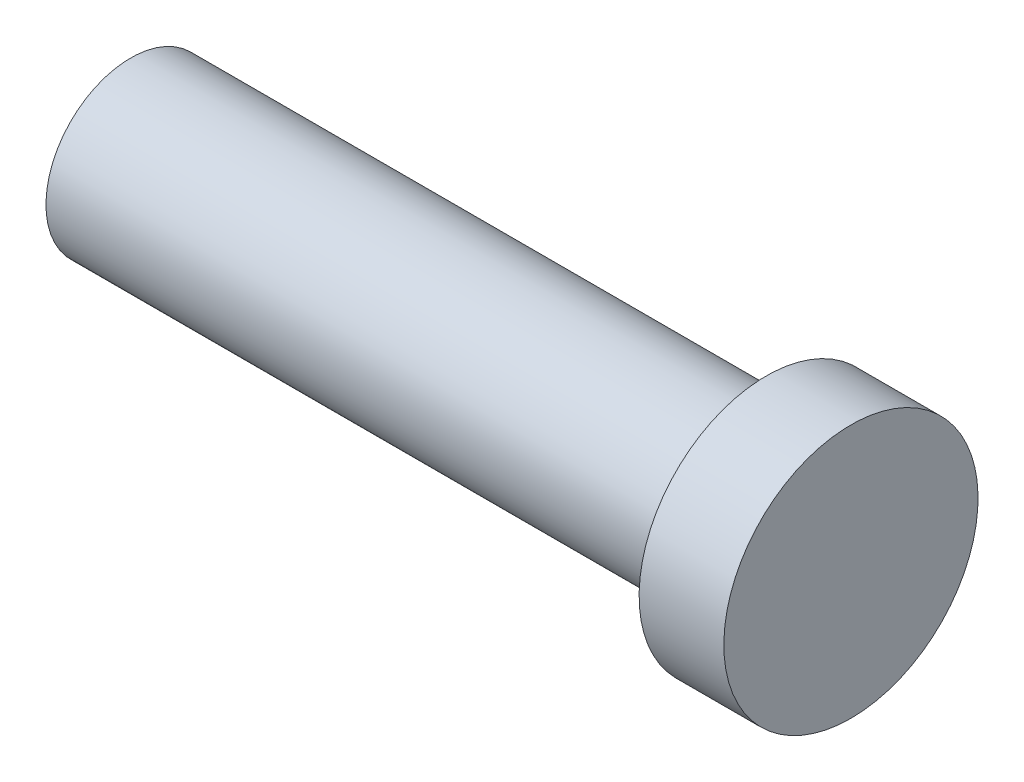
ISO-10303-21;
HEADER;
FILE_DESCRIPTION(('STEP AP214'),'2;1');
FILE_NAME('part.step','',(''),(''),'','','');
FILE_SCHEMA(('AUTOMOTIVE_DESIGN { 1 0 10303 214 1 1 1 1 }'));
ENDSEC;
DATA;
#1=APPLICATION_CONTEXT('core data for automotive mechanical design processes');
#2=APPLICATION_PROTOCOL_DEFINITION('international standard','automotive_design',2000,#1);
#3=PRODUCT_CONTEXT('',#1,'mechanical');
#4=PRODUCT('Part','Part','',(#3));
#5=PRODUCT_RELATED_PRODUCT_CATEGORY('part','',(#4));
#6=PRODUCT_DEFINITION_FORMATION('','',#4);
#7=PRODUCT_DEFINITION_CONTEXT('part definition',#1,'design');
#8=PRODUCT_DEFINITION('design','',#6,#7);
#9=PRODUCT_DEFINITION_SHAPE('','',#8);
#10=(LENGTH_UNIT() NAMED_UNIT(*) SI_UNIT(.MILLI.,.METRE.));
#11=(NAMED_UNIT(*) PLANE_ANGLE_UNIT() SI_UNIT($,.RADIAN.));
#12=(NAMED_UNIT(*) SI_UNIT($,.STERADIAN.) SOLID_ANGLE_UNIT());
#13=UNCERTAINTY_MEASURE_WITH_UNIT(LENGTH_MEASURE(1.E-05),#10,'distance_accuracy_value','');
#14=(GEOMETRIC_REPRESENTATION_CONTEXT(3) GLOBAL_UNCERTAINTY_ASSIGNED_CONTEXT((#13)) GLOBAL_UNIT_ASSIGNED_CONTEXT((#10,
#11,#12)) REPRESENTATION_CONTEXT('',''));
#15=CARTESIAN_POINT('',(0.,0.,0.));
#16=DIRECTION('',(0.,0.,1.));
#17=DIRECTION('',(1.,0.,0.));
#18=AXIS2_PLACEMENT_3D('',#15,#16,#17);
#19=CARTESIAN_POINT('',(-2.,0.,0.));
#20=DIRECTION('',(-1.,0.,0.));
#21=DIRECTION('',(0.,-1.,0.));
#22=AXIS2_PLACEMENT_3D('',#19,#20,#21);
#23=PLANE('',#22);
#24=CARTESIAN_POINT('',(-2.,0.,0.));
#25=DIRECTION('',(-1.,0.,0.));
#26=DIRECTION('',(0.,-1.,0.));
#27=AXIS2_PLACEMENT_3D('',#24,#25,#26);
#28=CIRCLE('',#27,3.);
#29=CARTESIAN_POINT('',(-2.,-3.,0.));
#30=VERTEX_POINT('',#29);
#31=EDGE_CURVE('E47',#30,#30,#28,.T.);
#32=ORIENTED_EDGE('',*,*,#31,.T.);
#33=EDGE_LOOP('',(#32));
#34=FACE_BOUND('',#33,.T.);
#35=CARTESIAN_POINT('',(-2.,0.,0.));
#36=DIRECTION('',(-1.,0.,0.));
#37=DIRECTION('',(0.,-1.,0.));
#38=AXIS2_PLACEMENT_3D('',#35,#36,#37);
#39=CIRCLE('',#38,2.);
#40=CARTESIAN_POINT('',(-2.,-2.,0.));
#41=VERTEX_POINT('',#40);
#42=EDGE_CURVE('E10',#41,#41,#39,.T.);
#43=ORIENTED_EDGE('',*,*,#42,.F.);
#44=EDGE_LOOP('',(#43));
#45=FACE_BOUND('',#44,.T.);
#46=ADVANCED_FACE('F33',(#34,#45),#23,.T.);
#47=CARTESIAN_POINT('',(-17.,0.,0.));
#48=DIRECTION('',(-1.,0.,0.));
#49=DIRECTION('',(0.,-1.,0.));
#50=AXIS2_PLACEMENT_3D('',#47,#48,#49);
#51=CYLINDRICAL_SURFACE('',#50,2.);
#52=CARTESIAN_POINT('',(-17.,0.,0.));
#53=DIRECTION('',(-1.,0.,0.));
#54=DIRECTION('',(0.,-1.,0.));
#55=AXIS2_PLACEMENT_3D('',#52,#53,#54);
#56=CIRCLE('',#55,2.);
#57=CARTESIAN_POINT('',(-17.,-2.,0.));
#58=VERTEX_POINT('',#57);
#59=EDGE_CURVE('E39',#58,#58,#56,.T.);
#60=ORIENTED_EDGE('',*,*,#59,.F.);
#61=EDGE_LOOP('',(#60));
#62=FACE_BOUND('',#61,.T.);
#63=ORIENTED_EDGE('',*,*,#42,.T.);
#64=EDGE_LOOP('',(#63));
#65=FACE_BOUND('',#64,.T.);
#66=ADVANCED_FACE('F68',(#62,#65),#51,.T.);
#67=CARTESIAN_POINT('',(-17.,0.,0.));
#68=DIRECTION('',(-1.,0.,0.));
#69=DIRECTION('',(0.,-1.,0.));
#70=AXIS2_PLACEMENT_3D('',#67,#68,#69);
#71=PLANE('',#70);
#72=ORIENTED_EDGE('',*,*,#59,.T.);
#73=EDGE_LOOP('',(#72));
#74=FACE_BOUND('',#73,.T.);
#75=ADVANCED_FACE('F63',(#74),#71,.T.);
#76=CARTESIAN_POINT('',(0.,0.,0.));
#77=DIRECTION('',(-1.,0.,0.));
#78=DIRECTION('',(0.,-1.,0.));
#79=AXIS2_PLACEMENT_3D('',#76,#77,#78);
#80=PLANE('',#79);
#81=CARTESIAN_POINT('',(0.,0.,0.));
#82=DIRECTION('',(-1.,0.,0.));
#83=DIRECTION('',(0.,-1.,0.));
#84=AXIS2_PLACEMENT_3D('',#81,#82,#83);
#85=CIRCLE('',#84,3.);
#86=CARTESIAN_POINT('',(0.,-3.,0.));
#87=VERTEX_POINT('',#86);
#88=EDGE_CURVE('E43',#87,#87,#85,.T.);
#89=ORIENTED_EDGE('',*,*,#88,.F.);
#90=EDGE_LOOP('',(#89));
#91=FACE_BOUND('',#90,.T.);
#92=ADVANCED_FACE('F58',(#91),#80,.F.);
#93=CARTESIAN_POINT('',(-17.,0.,0.));
#94=DIRECTION('',(-1.,0.,0.));
#95=DIRECTION('',(0.,-1.,0.));
#96=AXIS2_PLACEMENT_3D('',#93,#94,#95);
#97=CYLINDRICAL_SURFACE('',#96,3.);
#98=ORIENTED_EDGE('',*,*,#31,.F.);
#99=EDGE_LOOP('',(#98));
#100=FACE_BOUND('',#99,.T.);
#101=ORIENTED_EDGE('',*,*,#88,.T.);
#102=EDGE_LOOP('',(#101));
#103=FACE_BOUND('',#102,.T.);
#104=ADVANCED_FACE('F55',(#100,#103),#97,.T.);
#105=CLOSED_SHELL('',(#46,#66,#75,#92,#104));
#106=MANIFOLD_SOLID_BREP('B2',#105);
#107=ADVANCED_BREP_SHAPE_REPRESENTATION('',(#18,#106),#14);
#108=SHAPE_DEFINITION_REPRESENTATION(#9,#107);
ENDSEC;
END-ISO-10303-21;
